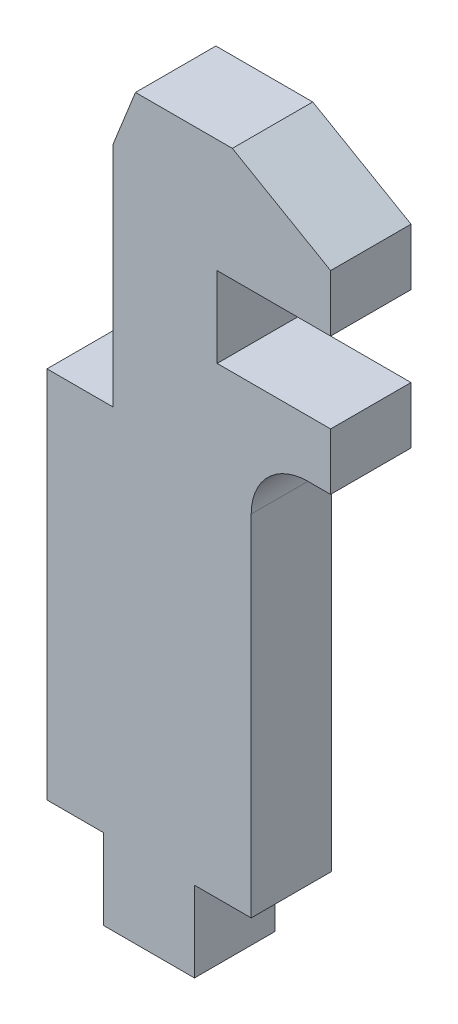
ISO-10303-21;
HEADER;
FILE_DESCRIPTION(('STEP AP214'),'2;1');
FILE_NAME('part.step','',(''),(''),'','','');
FILE_SCHEMA(('AUTOMOTIVE_DESIGN { 1 0 10303 214 1 1 1 1 }'));
ENDSEC;
DATA;
#1=APPLICATION_CONTEXT('core data for automotive mechanical design processes');
#2=APPLICATION_PROTOCOL_DEFINITION('international standard','automotive_design',2000,#1);
#3=PRODUCT_CONTEXT('',#1,'mechanical');
#4=PRODUCT('Part','Part','',(#3));
#5=PRODUCT_RELATED_PRODUCT_CATEGORY('part','',(#4));
#6=PRODUCT_DEFINITION_FORMATION('','',#4);
#7=PRODUCT_DEFINITION_CONTEXT('part definition',#1,'design');
#8=PRODUCT_DEFINITION('design','',#6,#7);
#9=PRODUCT_DEFINITION_SHAPE('','',#8);
#10=(LENGTH_UNIT() NAMED_UNIT(*) SI_UNIT(.MILLI.,.METRE.));
#11=(NAMED_UNIT(*) PLANE_ANGLE_UNIT() SI_UNIT($,.RADIAN.));
#12=(NAMED_UNIT(*) SI_UNIT($,.STERADIAN.) SOLID_ANGLE_UNIT());
#13=UNCERTAINTY_MEASURE_WITH_UNIT(LENGTH_MEASURE(1.E-05),#10,'distance_accuracy_value','');
#14=(GEOMETRIC_REPRESENTATION_CONTEXT(3) GLOBAL_UNCERTAINTY_ASSIGNED_CONTEXT((#13)) GLOBAL_UNIT_ASSIGNED_CONTEXT((#10,
#11,#12)) REPRESENTATION_CONTEXT('',''));
#15=CARTESIAN_POINT('',(0.,0.,0.));
#16=DIRECTION('',(0.,0.,1.));
#17=DIRECTION('',(1.,0.,0.));
#18=AXIS2_PLACEMENT_3D('',#15,#16,#17);
#19=CARTESIAN_POINT('',(3.683,10.45,2.25));
#20=DIRECTION('',(0.,-1.,0.));
#21=DIRECTION('',(0.,0.,-1.));
#22=AXIS2_PLACEMENT_3D('',#19,#20,#21);
#23=PLANE('',#22);
#24=DIRECTION('',(-1.,0.,0.));
#25=VECTOR('',#24,1.);
#26=CARTESIAN_POINT('',(3.683,10.45,-2.25));
#27=LINE('',#26,#25);
#28=CARTESIAN_POINT('',(3.683,10.45,-2.25));
#29=VERTEX_POINT('',#28);
#30=CARTESIAN_POINT('',(0.,10.45,-2.25));
#31=VERTEX_POINT('',#30);
#32=EDGE_CURVE('E205',#29,#31,#27,.T.);
#33=ORIENTED_EDGE('',*,*,#32,.T.);
#34=DIRECTION('',(0.,0.,-1.));
#35=VECTOR('',#34,1.);
#36=CARTESIAN_POINT('',(0.,10.45,2.25));
#37=LINE('',#36,#35);
#38=CARTESIAN_POINT('',(0.,10.45,2.25));
#39=VERTEX_POINT('',#38);
#40=EDGE_CURVE('E11',#39,#31,#37,.T.);
#41=ORIENTED_EDGE('',*,*,#40,.F.);
#42=DIRECTION('',(-1.,0.,0.));
#43=VECTOR('',#42,1.);
#44=CARTESIAN_POINT('',(3.683,10.45,2.25));
#45=LINE('',#44,#43);
#46=CARTESIAN_POINT('',(3.683,10.45,2.25));
#47=VERTEX_POINT('',#46);
#48=EDGE_CURVE('E206',#47,#39,#45,.T.);
#49=ORIENTED_EDGE('',*,*,#48,.F.);
#50=DIRECTION('',(0.,0.,-1.));
#51=VECTOR('',#50,1.);
#52=CARTESIAN_POINT('',(3.683,10.45,2.25));
#53=LINE('',#52,#51);
#54=EDGE_CURVE('E233',#47,#29,#53,.T.);
#55=ORIENTED_EDGE('',*,*,#54,.T.);
#56=EDGE_LOOP('',(#33,#41,#49,#55));
#57=FACE_BOUND('',#56,.T.);
#58=ADVANCED_FACE('F33',(#57),#23,.F.);
#59=CARTESIAN_POINT('',(0.,10.45,2.25));
#60=DIRECTION('',(1.,0.,0.));
#61=DIRECTION('',(0.,0.,-1.));
#62=AXIS2_PLACEMENT_3D('',#59,#60,#61);
#63=PLANE('',#62);
#64=DIRECTION('',(0.,-1.,0.));
#65=VECTOR('',#64,1.);
#66=CARTESIAN_POINT('',(0.,10.45,-2.25));
#67=LINE('',#66,#65);
#68=CARTESIAN_POINT('',(0.,-10.45,-2.25));
#69=VERTEX_POINT('',#68);
#70=EDGE_CURVE('E236',#31,#69,#67,.T.);
#71=ORIENTED_EDGE('',*,*,#70,.T.);
#72=DIRECTION('',(0.,0.,-1.));
#73=VECTOR('',#72,1.);
#74=CARTESIAN_POINT('',(0.,-10.45,2.25));
#75=LINE('',#74,#73);
#76=CARTESIAN_POINT('',(0.,-10.45,2.25));
#77=VERTEX_POINT('',#76);
#78=EDGE_CURVE('E41',#77,#69,#75,.T.);
#79=ORIENTED_EDGE('',*,*,#78,.F.);
#80=DIRECTION('',(0.,-1.,0.));
#81=VECTOR('',#80,1.);
#82=CARTESIAN_POINT('',(0.,10.45,2.25));
#83=LINE('',#82,#81);
#84=EDGE_CURVE('E113',#39,#77,#83,.T.);
#85=ORIENTED_EDGE('',*,*,#84,.F.);
#86=ORIENTED_EDGE('',*,*,#40,.T.);
#87=EDGE_LOOP('',(#71,#79,#85,#86));
#88=FACE_BOUND('',#87,.T.);
#89=ADVANCED_FACE('F324',(#88),#63,.F.);
#90=CARTESIAN_POINT('',(0.,-10.45,2.25));
#91=DIRECTION('',(0.,1.,0.));
#92=DIRECTION('',(0.,0.,1.));
#93=AXIS2_PLACEMENT_3D('',#90,#91,#92);
#94=PLANE('',#93);
#95=DIRECTION('',(1.,0.,0.));
#96=VECTOR('',#95,1.);
#97=CARTESIAN_POINT('',(0.,-10.45,-2.25));
#98=LINE('',#97,#96);
#99=CARTESIAN_POINT('',(3.175,-10.45,-2.25));
#100=VERTEX_POINT('',#99);
#101=EDGE_CURVE('E238',#69,#100,#98,.T.);
#102=ORIENTED_EDGE('',*,*,#101,.T.);
#103=DIRECTION('',(0.,0.,-1.));
#104=VECTOR('',#103,1.);
#105=CARTESIAN_POINT('',(3.175,-10.45,2.25));
#106=LINE('',#105,#104);
#107=CARTESIAN_POINT('',(3.175,-10.45,2.25));
#108=VERTEX_POINT('',#107);
#109=EDGE_CURVE('E297',#108,#100,#106,.T.);
#110=ORIENTED_EDGE('',*,*,#109,.F.);
#111=DIRECTION('',(1.,0.,0.));
#112=VECTOR('',#111,1.);
#113=CARTESIAN_POINT('',(0.,-10.45,2.25));
#114=LINE('',#113,#112);
#115=EDGE_CURVE('E209',#77,#108,#114,.T.);
#116=ORIENTED_EDGE('',*,*,#115,.F.);
#117=ORIENTED_EDGE('',*,*,#78,.T.);
#118=EDGE_LOOP('',(#102,#110,#116,#117));
#119=FACE_BOUND('',#118,.T.);
#120=ADVANCED_FACE('F303',(#119),#94,.F.);
#121=CARTESIAN_POINT('',(3.175,-10.45,2.25));
#122=DIRECTION('',(1.,0.,0.));
#123=DIRECTION('',(0.,1.,0.));
#124=AXIS2_PLACEMENT_3D('',#121,#122,#123);
#125=PLANE('',#124);
#126=DIRECTION('',(0.,-1.,0.));
#127=VECTOR('',#126,1.);
#128=CARTESIAN_POINT('',(3.175,-10.45,-2.25));
#129=LINE('',#128,#127);
#130=CARTESIAN_POINT('',(3.175,-14.95,-2.25));
#131=VERTEX_POINT('',#130);
#132=EDGE_CURVE('E240',#100,#131,#129,.T.);
#133=ORIENTED_EDGE('',*,*,#132,.T.);
#134=DIRECTION('',(0.,0.,-1.));
#135=VECTOR('',#134,1.);
#136=CARTESIAN_POINT('',(3.175,-14.95,2.25));
#137=LINE('',#136,#135);
#138=CARTESIAN_POINT('',(3.175,-14.95,2.25));
#139=VERTEX_POINT('',#138);
#140=EDGE_CURVE('E294',#139,#131,#137,.T.);
#141=ORIENTED_EDGE('',*,*,#140,.F.);
#142=DIRECTION('',(0.,-1.,0.));
#143=VECTOR('',#142,1.);
#144=CARTESIAN_POINT('',(3.175,-10.45,2.25));
#145=LINE('',#144,#143);
#146=EDGE_CURVE('E211',#108,#139,#145,.T.);
#147=ORIENTED_EDGE('',*,*,#146,.F.);
#148=ORIENTED_EDGE('',*,*,#109,.T.);
#149=EDGE_LOOP('',(#133,#141,#147,#148));
#150=FACE_BOUND('',#149,.T.);
#151=ADVANCED_FACE('F313',(#150),#125,.F.);
#152=CARTESIAN_POINT('',(3.175,-14.95,2.25));
#153=DIRECTION('',(0.,1.,0.));
#154=DIRECTION('',(-1.,0.,0.));
#155=AXIS2_PLACEMENT_3D('',#152,#153,#154);
#156=PLANE('',#155);
#157=DIRECTION('',(1.,0.,0.));
#158=VECTOR('',#157,1.);
#159=CARTESIAN_POINT('',(3.175,-14.95,-2.25));
#160=LINE('',#159,#158);
#161=CARTESIAN_POINT('',(8.25500000000001,-14.95,-2.25));
#162=VERTEX_POINT('',#161);
#163=EDGE_CURVE('E242',#131,#162,#160,.T.);
#164=ORIENTED_EDGE('',*,*,#163,.T.);
#165=DIRECTION('',(0.,0.,-1.));
#166=VECTOR('',#165,1.);
#167=CARTESIAN_POINT('',(8.25500000000001,-14.95,2.25));
#168=LINE('',#167,#166);
#169=CARTESIAN_POINT('',(8.25500000000001,-14.95,2.25));
#170=VERTEX_POINT('',#169);
#171=EDGE_CURVE('E291',#170,#162,#168,.T.);
#172=ORIENTED_EDGE('',*,*,#171,.F.);
#173=DIRECTION('',(1.,0.,0.));
#174=VECTOR('',#173,1.);
#175=CARTESIAN_POINT('',(3.175,-14.95,2.25));
#176=LINE('',#175,#174);
#177=EDGE_CURVE('E213',#139,#170,#176,.T.);
#178=ORIENTED_EDGE('',*,*,#177,.F.);
#179=ORIENTED_EDGE('',*,*,#140,.T.);
#180=EDGE_LOOP('',(#164,#172,#178,#179));
#181=FACE_BOUND('',#180,.T.);
#182=ADVANCED_FACE('F317',(#181),#156,.F.);
#183=CARTESIAN_POINT('',(8.25500000000001,-14.95,2.25));
#184=DIRECTION('',(-1.,0.,0.));
#185=DIRECTION('',(0.,-1.,0.));
#186=AXIS2_PLACEMENT_3D('',#183,#184,#185);
#187=PLANE('',#186);
#188=DIRECTION('',(0.,1.,0.));
#189=VECTOR('',#188,1.);
#190=CARTESIAN_POINT('',(8.25500000000001,-14.95,-2.25));
#191=LINE('',#190,#189);
#192=CARTESIAN_POINT('',(8.255,-10.45,-2.25));
#193=VERTEX_POINT('',#192);
#194=EDGE_CURVE('E244',#162,#193,#191,.T.);
#195=ORIENTED_EDGE('',*,*,#194,.T.);
#196=DIRECTION('',(0.,0.,-1.));
#197=VECTOR('',#196,1.);
#198=CARTESIAN_POINT('',(8.255,-10.45,2.25));
#199=LINE('',#198,#197);
#200=CARTESIAN_POINT('',(8.255,-10.45,2.25));
#201=VERTEX_POINT('',#200);
#202=EDGE_CURVE('E288',#201,#193,#199,.T.);
#203=ORIENTED_EDGE('',*,*,#202,.F.);
#204=DIRECTION('',(0.,1.,0.));
#205=VECTOR('',#204,1.);
#206=CARTESIAN_POINT('',(8.25500000000001,-14.95,2.25));
#207=LINE('',#206,#205);
#208=EDGE_CURVE('E215',#170,#201,#207,.T.);
#209=ORIENTED_EDGE('',*,*,#208,.F.);
#210=ORIENTED_EDGE('',*,*,#171,.T.);
#211=EDGE_LOOP('',(#195,#203,#209,#210));
#212=FACE_BOUND('',#211,.T.);
#213=ADVANCED_FACE('F336',(#212),#187,.F.);
#214=CARTESIAN_POINT('',(8.255,-10.45,2.25));
#215=DIRECTION('',(0.,1.,0.));
#216=DIRECTION('',(0.,0.,1.));
#217=AXIS2_PLACEMENT_3D('',#214,#215,#216);
#218=PLANE('',#217);
#219=DIRECTION('',(1.,0.,0.));
#220=VECTOR('',#219,1.);
#221=CARTESIAN_POINT('',(8.255,-10.45,-2.25));
#222=LINE('',#221,#220);
#223=CARTESIAN_POINT('',(11.43,-10.45,-2.25));
#224=VERTEX_POINT('',#223);
#225=EDGE_CURVE('E246',#193,#224,#222,.T.);
#226=ORIENTED_EDGE('',*,*,#225,.T.);
#227=DIRECTION('',(0.,0.,-1.));
#228=VECTOR('',#227,1.);
#229=CARTESIAN_POINT('',(11.43,-10.45,2.25));
#230=LINE('',#229,#228);
#231=CARTESIAN_POINT('',(11.43,-10.45,2.25));
#232=VERTEX_POINT('',#231);
#233=EDGE_CURVE('E285',#232,#224,#230,.T.);
#234=ORIENTED_EDGE('',*,*,#233,.F.);
#235=DIRECTION('',(1.,0.,0.));
#236=VECTOR('',#235,1.);
#237=CARTESIAN_POINT('',(8.255,-10.45,2.25));
#238=LINE('',#237,#236);
#239=EDGE_CURVE('E217',#201,#232,#238,.T.);
#240=ORIENTED_EDGE('',*,*,#239,.F.);
#241=ORIENTED_EDGE('',*,*,#202,.T.);
#242=EDGE_LOOP('',(#226,#234,#240,#241));
#243=FACE_BOUND('',#242,.T.);
#244=ADVANCED_FACE('F339',(#243),#218,.F.);
#245=CARTESIAN_POINT('',(11.43,-10.45,2.25));
#246=DIRECTION('',(-1.,0.,0.));
#247=DIRECTION('',(0.,0.,1.));
#248=AXIS2_PLACEMENT_3D('',#245,#246,#247);
#249=PLANE('',#248);
#250=DIRECTION('',(0.,1.,0.));
#251=VECTOR('',#250,1.);
#252=CARTESIAN_POINT('',(11.43,-10.45,-2.25));
#253=LINE('',#252,#251);
#254=CARTESIAN_POINT('',(11.43,9.125,-2.25));
#255=VERTEX_POINT('',#254);
#256=EDGE_CURVE('E248',#224,#255,#253,.T.);
#257=ORIENTED_EDGE('',*,*,#256,.T.);
#258=DIRECTION('',(0.,0.,-1.));
#259=VECTOR('',#258,1.);
#260=CARTESIAN_POINT('',(11.43,9.125,2.25));
#261=LINE('',#260,#259);
#262=CARTESIAN_POINT('',(11.43,9.125,2.25));
#263=VERTEX_POINT('',#262);
#264=EDGE_CURVE('E282',#263,#255,#261,.T.);
#265=ORIENTED_EDGE('',*,*,#264,.F.);
#266=DIRECTION('',(0.,1.,0.));
#267=VECTOR('',#266,1.);
#268=CARTESIAN_POINT('',(11.43,-10.45,2.25));
#269=LINE('',#268,#267);
#270=EDGE_CURVE('E219',#232,#263,#269,.T.);
#271=ORIENTED_EDGE('',*,*,#270,.F.);
#272=ORIENTED_EDGE('',*,*,#233,.T.);
#273=EDGE_LOOP('',(#257,#265,#271,#272));
#274=FACE_BOUND('',#273,.T.);
#275=ADVANCED_FACE('F343',(#274),#249,.F.);
#276=CARTESIAN_POINT('',(14.605,9.125,2.25));
#277=DIRECTION('',(0.,0.,-1.));
#278=DIRECTION('',(-1.,0.,0.));
#279=AXIS2_PLACEMENT_3D('',#276,#277,#278);
#280=CYLINDRICAL_SURFACE('',#279,3.17500000000001);
#281=CARTESIAN_POINT('',(14.605,9.125,-2.25));
#282=DIRECTION('',(0.,0.,-1.));
#283=DIRECTION('',(1.,0.,0.));
#284=AXIS2_PLACEMENT_3D('',#281,#282,#283);
#285=CIRCLE('',#284,3.17500000000001);
#286=CARTESIAN_POINT('',(14.605,12.3,-2.25));
#287=VERTEX_POINT('',#286);
#288=EDGE_CURVE('E250',#255,#287,#285,.T.);
#289=ORIENTED_EDGE('',*,*,#288,.T.);
#290=DIRECTION('',(0.,0.,-1.));
#291=VECTOR('',#290,1.);
#292=CARTESIAN_POINT('',(14.605,12.3,2.25));
#293=LINE('',#292,#291);
#294=CARTESIAN_POINT('',(14.605,12.3,2.25));
#295=VERTEX_POINT('',#294);
#296=EDGE_CURVE('E279',#295,#287,#293,.T.);
#297=ORIENTED_EDGE('',*,*,#296,.F.);
#298=CARTESIAN_POINT('',(14.605,9.125,2.25));
#299=DIRECTION('',(0.,0.,-1.));
#300=DIRECTION('',(1.,0.,0.));
#301=AXIS2_PLACEMENT_3D('',#298,#299,#300);
#302=CIRCLE('',#301,3.17500000000001);
#303=EDGE_CURVE('E221',#263,#295,#302,.T.);
#304=ORIENTED_EDGE('',*,*,#303,.F.);
#305=ORIENTED_EDGE('',*,*,#264,.T.);
#306=EDGE_LOOP('',(#289,#297,#304,#305));
#307=FACE_BOUND('',#306,.T.);
#308=ADVANCED_FACE('F347',(#307),#280,.F.);
#309=CARTESIAN_POINT('',(15.875,12.3,2.25));
#310=DIRECTION('',(0.,1.,0.));
#311=DIRECTION('',(-1.,0.,0.));
#312=AXIS2_PLACEMENT_3D('',#309,#310,#311);
#313=PLANE('',#312);
#314=DIRECTION('',(1.,0.,0.));
#315=VECTOR('',#314,1.);
#316=CARTESIAN_POINT('',(15.875,12.3,-2.25));
#317=LINE('',#316,#315);
#318=CARTESIAN_POINT('',(15.875,12.3,-2.25));
#319=VERTEX_POINT('',#318);
#320=EDGE_CURVE('E252',#287,#319,#317,.T.);
#321=ORIENTED_EDGE('',*,*,#320,.T.);
#322=DIRECTION('',(0.,0.,-1.));
#323=VECTOR('',#322,1.);
#324=CARTESIAN_POINT('',(15.875,12.3,2.25));
#325=LINE('',#324,#323);
#326=CARTESIAN_POINT('',(15.875,12.3,2.25));
#327=VERTEX_POINT('',#326);
#328=EDGE_CURVE('E276',#327,#319,#325,.T.);
#329=ORIENTED_EDGE('',*,*,#328,.F.);
#330=DIRECTION('',(1.,0.,0.));
#331=VECTOR('',#330,1.);
#332=CARTESIAN_POINT('',(15.875,12.3,2.25));
#333=LINE('',#332,#331);
#334=EDGE_CURVE('E223',#295,#327,#333,.T.);
#335=ORIENTED_EDGE('',*,*,#334,.F.);
#336=ORIENTED_EDGE('',*,*,#296,.T.);
#337=EDGE_LOOP('',(#321,#329,#335,#336));
#338=FACE_BOUND('',#337,.T.);
#339=ADVANCED_FACE('F351',(#338),#313,.F.);
#340=CARTESIAN_POINT('',(15.875,12.3,2.25));
#341=DIRECTION('',(-1.,0.,0.));
#342=DIRECTION('',(0.,0.,1.));
#343=AXIS2_PLACEMENT_3D('',#340,#341,#342);
#344=PLANE('',#343);
#345=DIRECTION('',(0.,1.,0.));
#346=VECTOR('',#345,1.);
#347=CARTESIAN_POINT('',(15.875,12.3,-2.25));
#348=LINE('',#347,#346);
#349=CARTESIAN_POINT('',(15.875,15.475,-2.25));
#350=VERTEX_POINT('',#349);
#351=EDGE_CURVE('E254',#319,#350,#348,.T.);
#352=ORIENTED_EDGE('',*,*,#351,.T.);
#353=DIRECTION('',(0.,0.,-1.));
#354=VECTOR('',#353,1.);
#355=CARTESIAN_POINT('',(15.875,15.475,2.25));
#356=LINE('',#355,#354);
#357=CARTESIAN_POINT('',(15.875,15.475,2.25));
#358=VERTEX_POINT('',#357);
#359=EDGE_CURVE('E273',#358,#350,#356,.T.);
#360=ORIENTED_EDGE('',*,*,#359,.F.);
#361=DIRECTION('',(0.,1.,0.));
#362=VECTOR('',#361,1.);
#363=CARTESIAN_POINT('',(15.875,12.3,2.25));
#364=LINE('',#363,#362);
#365=EDGE_CURVE('E225',#327,#358,#364,.T.);
#366=ORIENTED_EDGE('',*,*,#365,.F.);
#367=ORIENTED_EDGE('',*,*,#328,.T.);
#368=EDGE_LOOP('',(#352,#360,#366,#367));
#369=FACE_BOUND('',#368,.T.);
#370=ADVANCED_FACE('F355',(#369),#344,.F.);
#371=CARTESIAN_POINT('',(15.875,15.475,2.25));
#372=DIRECTION('',(0.,-1.,0.));
#373=DIRECTION('',(0.,0.,-1.));
#374=AXIS2_PLACEMENT_3D('',#371,#372,#373);
#375=PLANE('',#374);
#376=DIRECTION('',(-1.,0.,0.));
#377=VECTOR('',#376,1.);
#378=CARTESIAN_POINT('',(15.875,15.475,-2.25));
#379=LINE('',#378,#377);
#380=CARTESIAN_POINT('',(9.525,15.475,-2.25));
#381=VERTEX_POINT('',#380);
#382=EDGE_CURVE('E256',#350,#381,#379,.T.);
#383=ORIENTED_EDGE('',*,*,#382,.T.);
#384=DIRECTION('',(0.,0.,-1.));
#385=VECTOR('',#384,1.);
#386=CARTESIAN_POINT('',(9.525,15.475,2.25));
#387=LINE('',#386,#385);
#388=CARTESIAN_POINT('',(9.525,15.475,2.25));
#389=VERTEX_POINT('',#388);
#390=EDGE_CURVE('E270',#389,#381,#387,.T.);
#391=ORIENTED_EDGE('',*,*,#390,.F.);
#392=DIRECTION('',(-1.,0.,0.));
#393=VECTOR('',#392,1.);
#394=CARTESIAN_POINT('',(15.875,15.475,2.25));
#395=LINE('',#394,#393);
#396=EDGE_CURVE('E227',#358,#389,#395,.T.);
#397=ORIENTED_EDGE('',*,*,#396,.F.);
#398=ORIENTED_EDGE('',*,*,#359,.T.);
#399=EDGE_LOOP('',(#383,#391,#397,#398));
#400=FACE_BOUND('',#399,.T.);
#401=ADVANCED_FACE('F359',(#400),#375,.F.);
#402=CARTESIAN_POINT('',(9.525,19.975,2.25));
#403=DIRECTION('',(-1.,0.,0.));
#404=DIRECTION('',(0.,0.,1.));
#405=AXIS2_PLACEMENT_3D('',#402,#403,#404);
#406=PLANE('',#405);
#407=DIRECTION('',(0.,1.,0.));
#408=VECTOR('',#407,1.);
#409=CARTESIAN_POINT('',(9.525,19.975,-2.25));
#410=LINE('',#409,#408);
#411=CARTESIAN_POINT('',(9.525,19.975,-2.25));
#412=VERTEX_POINT('',#411);
#413=EDGE_CURVE('E258',#381,#412,#410,.T.);
#414=ORIENTED_EDGE('',*,*,#413,.T.);
#415=DIRECTION('',(0.,0.,-1.));
#416=VECTOR('',#415,1.);
#417=CARTESIAN_POINT('',(9.525,19.975,2.25));
#418=LINE('',#417,#416);
#419=CARTESIAN_POINT('',(9.525,19.975,2.25));
#420=VERTEX_POINT('',#419);
#421=EDGE_CURVE('E267',#420,#412,#418,.T.);
#422=ORIENTED_EDGE('',*,*,#421,.F.);
#423=DIRECTION('',(0.,1.,0.));
#424=VECTOR('',#423,1.);
#425=CARTESIAN_POINT('',(9.525,19.975,2.25));
#426=LINE('',#425,#424);
#427=EDGE_CURVE('E229',#389,#420,#426,.T.);
#428=ORIENTED_EDGE('',*,*,#427,.F.);
#429=ORIENTED_EDGE('',*,*,#390,.T.);
#430=EDGE_LOOP('',(#414,#422,#428,#429));
#431=FACE_BOUND('',#430,.T.);
#432=ADVANCED_FACE('F363',(#431),#406,.F.);
#433=CARTESIAN_POINT('',(9.525,19.975,2.25));
#434=DIRECTION('',(0.,1.,0.));
#435=DIRECTION('',(0.,0.,1.));
#436=AXIS2_PLACEMENT_3D('',#433,#434,#435);
#437=PLANE('',#436);
#438=DIRECTION('',(1.,0.,0.));
#439=VECTOR('',#438,1.);
#440=CARTESIAN_POINT('',(9.525,19.975,-2.25));
#441=LINE('',#440,#439);
#442=CARTESIAN_POINT('',(15.875,19.975,-2.25));
#443=VERTEX_POINT('',#442);
#444=EDGE_CURVE('E260',#412,#443,#441,.T.);
#445=ORIENTED_EDGE('',*,*,#444,.T.);
#446=DIRECTION('',(0.,0.,-1.));
#447=VECTOR('',#446,1.);
#448=CARTESIAN_POINT('',(15.875,19.975,2.25));
#449=LINE('',#448,#447);
#450=CARTESIAN_POINT('',(15.875,19.975,2.25));
#451=VERTEX_POINT('',#450);
#452=EDGE_CURVE('E181',#451,#443,#449,.T.);
#453=ORIENTED_EDGE('',*,*,#452,.F.);
#454=DIRECTION('',(1.,0.,0.));
#455=VECTOR('',#454,1.);
#456=CARTESIAN_POINT('',(9.525,19.975,2.25));
#457=LINE('',#456,#455);
#458=EDGE_CURVE('E166',#420,#451,#457,.T.);
#459=ORIENTED_EDGE('',*,*,#458,.F.);
#460=ORIENTED_EDGE('',*,*,#421,.T.);
#461=EDGE_LOOP('',(#445,#453,#459,#460));
#462=FACE_BOUND('',#461,.T.);
#463=ADVANCED_FACE('F367',(#462),#437,.F.);
#464=CARTESIAN_POINT('',(15.875,19.975,2.25));
#465=DIRECTION('',(-1.,0.,0.));
#466=DIRECTION('',(0.,0.,1.));
#467=AXIS2_PLACEMENT_3D('',#464,#465,#466);
#468=PLANE('',#467);
#469=DIRECTION('',(0.,1.,0.));
#470=VECTOR('',#469,1.);
#471=CARTESIAN_POINT('',(15.875,19.975,-2.25));
#472=LINE('',#471,#470);
#473=CARTESIAN_POINT('',(15.875,23.15,-2.249999945));
#474=VERTEX_POINT('',#473);
#475=EDGE_CURVE('E177',#443,#474,#472,.T.);
#476=ORIENTED_EDGE('',*,*,#475,.T.);
#477=DIRECTION('',(0.,0.,-1.));
#478=VECTOR('',#477,1.);
#479=CARTESIAN_POINT('',(15.875,23.15,2.25));
#480=LINE('',#479,#478);
#481=CARTESIAN_POINT('',(15.875,23.15,2.25));
#482=VERTEX_POINT('',#481);
#483=EDGE_CURVE('E173',#482,#474,#480,.T.);
#484=ORIENTED_EDGE('',*,*,#483,.F.);
#485=DIRECTION('',(0.,1.,0.));
#486=VECTOR('',#485,1.);
#487=CARTESIAN_POINT('',(15.875,19.975,2.25));
#488=LINE('',#487,#486);
#489=EDGE_CURVE('E157',#451,#482,#488,.T.);
#490=ORIENTED_EDGE('',*,*,#489,.F.);
#491=ORIENTED_EDGE('',*,*,#452,.T.);
#492=EDGE_LOOP('',(#476,#484,#490,#491));
#493=FACE_BOUND('',#492,.T.);
#494=ADVANCED_FACE('F174',(#493),#468,.F.);
#495=CARTESIAN_POINT('',(3.683,23.15,2.25));
#496=DIRECTION('',(1.,0.,0.));
#497=DIRECTION('',(0.,1.,0.));
#498=AXIS2_PLACEMENT_3D('',#495,#496,#497);
#499=PLANE('',#498);
#500=DIRECTION('',(0.,-1.,0.));
#501=VECTOR('',#500,1.);
#502=CARTESIAN_POINT('',(3.683,23.15,-2.25));
#503=LINE('',#502,#501);
#504=CARTESIAN_POINT('',(3.683,23.15,-2.25));
#505=VERTEX_POINT('',#504);
#506=EDGE_CURVE('E105',#505,#29,#503,.T.);
#507=ORIENTED_EDGE('',*,*,#506,.T.);
#508=ORIENTED_EDGE('',*,*,#54,.F.);
#509=DIRECTION('',(0.,-1.,0.));
#510=VECTOR('',#509,1.);
#511=CARTESIAN_POINT('',(3.683,23.15,2.25));
#512=LINE('',#511,#510);
#513=CARTESIAN_POINT('',(3.683,23.15,2.25));
#514=VERTEX_POINT('',#513);
#515=EDGE_CURVE('E49',#514,#47,#512,.T.);
#516=ORIENTED_EDGE('',*,*,#515,.F.);
#517=DIRECTION('',(0.,0.,-1.));
#518=VECTOR('',#517,1.);
#519=CARTESIAN_POINT('',(3.683,23.15,2.25));
#520=LINE('',#519,#518);
#521=EDGE_CURVE('E102',#514,#505,#520,.T.);
#522=ORIENTED_EDGE('',*,*,#521,.T.);
#523=EDGE_LOOP('',(#507,#508,#516,#522));
#524=FACE_BOUND('',#523,.T.);
#525=ADVANCED_FACE('F374',(#524),#499,.F.);
#526=CARTESIAN_POINT('',(14.605,9.125,2.25));
#527=DIRECTION('',(0.,0.,1.));
#528=DIRECTION('',(1.,0.,0.));
#529=AXIS2_PLACEMENT_3D('',#526,#527,#528);
#530=PLANE('',#529);
#531=ORIENTED_EDGE('',*,*,#84,.T.);
#532=ORIENTED_EDGE('',*,*,#115,.T.);
#533=ORIENTED_EDGE('',*,*,#146,.T.);
#534=ORIENTED_EDGE('',*,*,#177,.T.);
#535=ORIENTED_EDGE('',*,*,#208,.T.);
#536=ORIENTED_EDGE('',*,*,#239,.T.);
#537=ORIENTED_EDGE('',*,*,#270,.T.);
#538=ORIENTED_EDGE('',*,*,#303,.T.);
#539=ORIENTED_EDGE('',*,*,#334,.T.);
#540=ORIENTED_EDGE('',*,*,#365,.T.);
#541=ORIENTED_EDGE('',*,*,#396,.T.);
#542=ORIENTED_EDGE('',*,*,#427,.T.);
#543=ORIENTED_EDGE('',*,*,#458,.T.);
#544=ORIENTED_EDGE('',*,*,#489,.T.);
#545=DIRECTION('',(-0.866025403784442,0.499999999999995,0.));
#546=VECTOR('',#545,1.);
#547=CARTESIAN_POINT('',(10.3757386859687,26.325,2.249999945));
#548=LINE('',#547,#546);
#549=CARTESIAN_POINT('',(10.3757386859687,26.325,2.249999945));
#550=VERTEX_POINT('',#549);
#551=EDGE_CURVE('E163',#482,#550,#548,.T.);
#552=ORIENTED_EDGE('',*,*,#551,.T.);
#553=DIRECTION('',(-1.,0.,0.));
#554=VECTOR('',#553,1.);
#555=CARTESIAN_POINT('',(4.953,26.325,2.249999945));
#556=LINE('',#555,#554);
#557=CARTESIAN_POINT('',(4.953,26.325,2.249999945));
#558=VERTEX_POINT('',#557);
#559=EDGE_CURVE('E187',#550,#558,#556,.T.);
#560=ORIENTED_EDGE('',*,*,#559,.T.);
#561=DIRECTION('',(-0.371390676354104,-0.928476690885259,0.));
#562=VECTOR('',#561,1.);
#563=CARTESIAN_POINT('',(3.683,23.15,2.249999945));
#564=LINE('',#563,#562);
#565=EDGE_CURVE('E190',#558,#514,#564,.T.);
#566=ORIENTED_EDGE('',*,*,#565,.T.);
#567=ORIENTED_EDGE('',*,*,#515,.T.);
#568=ORIENTED_EDGE('',*,*,#48,.T.);
#569=EDGE_LOOP('',(#531,#532,#533,#534,#535,#536,#537,#538,#539,#540,#541,#542,#543,#544,#552,
#560,#566,#567,#568));
#570=FACE_BOUND('',#569,.T.);
#571=ADVANCED_FACE('F159',(#570),#530,.T.);
#572=CARTESIAN_POINT('',(14.605,9.125,-2.25));
#573=DIRECTION('',(0.,0.,1.));
#574=DIRECTION('',(1.,0.,0.));
#575=AXIS2_PLACEMENT_3D('',#572,#573,#574);
#576=PLANE('',#575);
#577=ORIENTED_EDGE('',*,*,#101,.F.);
#578=ORIENTED_EDGE('',*,*,#70,.F.);
#579=ORIENTED_EDGE('',*,*,#32,.F.);
#580=ORIENTED_EDGE('',*,*,#506,.F.);
#581=DIRECTION('',(-0.371390676354104,-0.928476690885259,0.));
#582=VECTOR('',#581,1.);
#583=CARTESIAN_POINT('',(3.683,23.15,-2.249999945));
#584=LINE('',#583,#582);
#585=CARTESIAN_POINT('',(4.953,26.325,-2.249999945));
#586=VERTEX_POINT('',#585);
#587=EDGE_CURVE('E188',#586,#505,#584,.T.);
#588=ORIENTED_EDGE('',*,*,#587,.F.);
#589=DIRECTION('',(-1.,0.,0.));
#590=VECTOR('',#589,1.);
#591=CARTESIAN_POINT('',(4.953,26.325,-2.249999945));
#592=LINE('',#591,#590);
#593=CARTESIAN_POINT('',(10.3757386859687,26.325,-2.249999945));
#594=VERTEX_POINT('',#593);
#595=EDGE_CURVE('E193',#594,#586,#592,.T.);
#596=ORIENTED_EDGE('',*,*,#595,.F.);
#597=DIRECTION('',(-0.866025403784442,0.499999999999995,0.));
#598=VECTOR('',#597,1.);
#599=CARTESIAN_POINT('',(10.3757386859687,26.325,-2.249999945));
#600=LINE('',#599,#598);
#601=EDGE_CURVE('E198',#474,#594,#600,.T.);
#602=ORIENTED_EDGE('',*,*,#601,.F.);
#603=ORIENTED_EDGE('',*,*,#475,.F.);
#604=ORIENTED_EDGE('',*,*,#444,.F.);
#605=ORIENTED_EDGE('',*,*,#413,.F.);
#606=ORIENTED_EDGE('',*,*,#382,.F.);
#607=ORIENTED_EDGE('',*,*,#351,.F.);
#608=ORIENTED_EDGE('',*,*,#320,.F.);
#609=ORIENTED_EDGE('',*,*,#288,.F.);
#610=ORIENTED_EDGE('',*,*,#256,.F.);
#611=ORIENTED_EDGE('',*,*,#225,.F.);
#612=ORIENTED_EDGE('',*,*,#194,.F.);
#613=ORIENTED_EDGE('',*,*,#163,.F.);
#614=ORIENTED_EDGE('',*,*,#132,.F.);
#615=EDGE_LOOP('',(#577,#578,#579,#580,#588,#596,#602,#603,#604,#605,#606,#607,#608,#609,#610,
#611,#612,#613,#614));
#616=FACE_BOUND('',#615,.T.);
#617=ADVANCED_FACE('F307',(#616),#576,.F.);
#618=CARTESIAN_POINT('',(10.3757386859687,26.325,2.249999945));
#619=DIRECTION('',(-0.499999999999995,-0.866025403784442,0.));
#620=DIRECTION('',(0.866025403784442,-0.499999999999995,0.));
#621=AXIS2_PLACEMENT_3D('',#618,#619,#620);
#622=PLANE('',#621);
#623=ORIENTED_EDGE('',*,*,#601,.T.);
#624=DIRECTION('',(0.,0.,-1.));
#625=VECTOR('',#624,1.);
#626=CARTESIAN_POINT('',(10.3757386859687,26.325,2.249999945));
#627=LINE('',#626,#625);
#628=EDGE_CURVE('E185',#550,#594,#627,.T.);
#629=ORIENTED_EDGE('',*,*,#628,.F.);
#630=ORIENTED_EDGE('',*,*,#551,.F.);
#631=ORIENTED_EDGE('',*,*,#483,.T.);
#632=EDGE_LOOP('',(#623,#629,#630,#631));
#633=FACE_BOUND('',#632,.T.);
#634=ADVANCED_FACE('F183',(#633),#622,.F.);
#635=CARTESIAN_POINT('',(4.953,26.325,2.249999945));
#636=DIRECTION('',(0.,-1.,0.));
#637=DIRECTION('',(0.,0.,-1.));
#638=AXIS2_PLACEMENT_3D('',#635,#636,#637);
#639=PLANE('',#638);
#640=ORIENTED_EDGE('',*,*,#595,.T.);
#641=DIRECTION('',(0.,0.,-1.));
#642=VECTOR('',#641,1.);
#643=CARTESIAN_POINT('',(4.953,26.325,2.249999945));
#644=LINE('',#643,#642);
#645=EDGE_CURVE('E197',#558,#586,#644,.T.);
#646=ORIENTED_EDGE('',*,*,#645,.F.);
#647=ORIENTED_EDGE('',*,*,#559,.F.);
#648=ORIENTED_EDGE('',*,*,#628,.T.);
#649=EDGE_LOOP('',(#640,#646,#647,#648));
#650=FACE_BOUND('',#649,.T.);
#651=ADVANCED_FACE('F383',(#650),#639,.F.);
#652=CARTESIAN_POINT('',(3.683,23.15,2.249999945));
#653=DIRECTION('',(0.928476690885259,-0.371390676354104,0.));
#654=DIRECTION('',(0.371390676354104,0.928476690885259,0.));
#655=AXIS2_PLACEMENT_3D('',#652,#653,#654);
#656=PLANE('',#655);
#657=ORIENTED_EDGE('',*,*,#587,.T.);
#658=ORIENTED_EDGE('',*,*,#521,.F.);
#659=ORIENTED_EDGE('',*,*,#565,.F.);
#660=ORIENTED_EDGE('',*,*,#645,.T.);
#661=EDGE_LOOP('',(#657,#658,#659,#660));
#662=FACE_BOUND('',#661,.T.);
#663=ADVANCED_FACE('F386',(#662),#656,.F.);
#664=CLOSED_SHELL('',(#58,#89,#120,#151,#182,#213,#244,#275,#308,#339,#370,#401,#432,#463,#494,
#525,#571,#617,#634,#651,#663));
#665=MANIFOLD_SOLID_BREP('B2',#664);
#666=ADVANCED_BREP_SHAPE_REPRESENTATION('',(#18,#665),#14);
#667=SHAPE_DEFINITION_REPRESENTATION(#9,#666);
ENDSEC;
END-ISO-10303-21;
